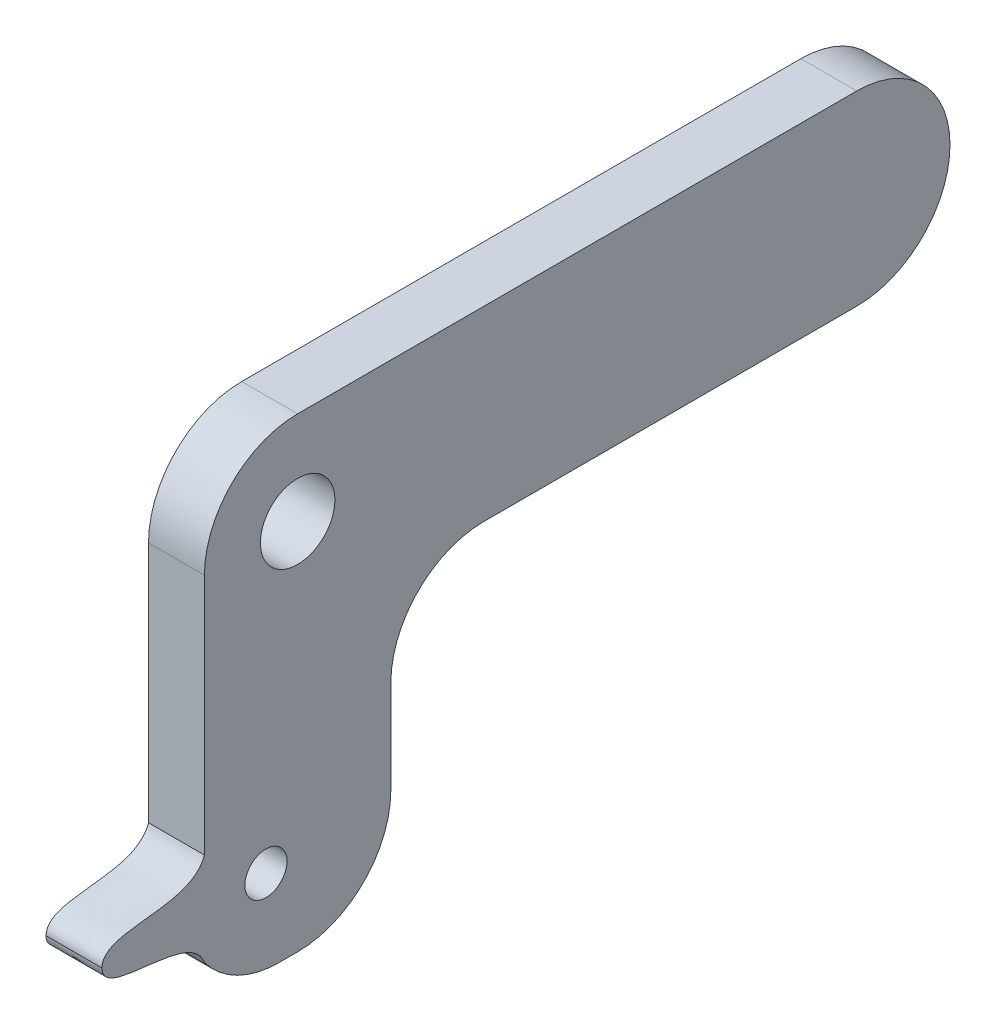
ISO-10303-21;
HEADER;
FILE_DESCRIPTION(('STEP AP214'),'2;1');
FILE_NAME('part.step','',(''),(''),'','','');
FILE_SCHEMA(('AUTOMOTIVE_DESIGN { 1 0 10303 214 1 1 1 1 }'));
ENDSEC;
DATA;
#1=APPLICATION_CONTEXT('core data for automotive mechanical design processes');
#2=APPLICATION_PROTOCOL_DEFINITION('international standard','automotive_design',2000,#1);
#3=PRODUCT_CONTEXT('',#1,'mechanical');
#4=PRODUCT('Part','Part','',(#3));
#5=PRODUCT_RELATED_PRODUCT_CATEGORY('part','',(#4));
#6=PRODUCT_DEFINITION_FORMATION('','',#4);
#7=PRODUCT_DEFINITION_CONTEXT('part definition',#1,'design');
#8=PRODUCT_DEFINITION('design','',#6,#7);
#9=PRODUCT_DEFINITION_SHAPE('','',#8);
#10=(LENGTH_UNIT() NAMED_UNIT(*) SI_UNIT(.MILLI.,.METRE.));
#11=(NAMED_UNIT(*) PLANE_ANGLE_UNIT() SI_UNIT($,.RADIAN.));
#12=(NAMED_UNIT(*) SI_UNIT($,.STERADIAN.) SOLID_ANGLE_UNIT());
#13=UNCERTAINTY_MEASURE_WITH_UNIT(LENGTH_MEASURE(1.E-05),#10,'distance_accuracy_value','');
#14=(GEOMETRIC_REPRESENTATION_CONTEXT(3) GLOBAL_UNCERTAINTY_ASSIGNED_CONTEXT((#13)) GLOBAL_UNIT_ASSIGNED_CONTEXT((#10,
#11,#12)) REPRESENTATION_CONTEXT('',''));
#15=CARTESIAN_POINT('',(0.,0.,0.));
#16=DIRECTION('',(0.,0.,1.));
#17=DIRECTION('',(1.,0.,0.));
#18=AXIS2_PLACEMENT_3D('',#15,#16,#17);
#19=CARTESIAN_POINT('',(3.,0.,0.));
#20=DIRECTION('',(-1.,0.,0.));
#21=DIRECTION('',(0.,0.,1.));
#22=AXIS2_PLACEMENT_3D('',#19,#20,#21);
#23=PLANE('',#22);
#24=CARTESIAN_POINT('',(3.,-15.5,1.7));
#25=DIRECTION('',(1.,0.,0.));
#26=DIRECTION('',(0.,0.,-1.));
#27=AXIS2_PLACEMENT_3D('',#24,#25,#26);
#28=CIRCLE('',#27,1.1303);
#29=CARTESIAN_POINT('',(3.,-15.5,0.569699999999999));
#30=VERTEX_POINT('',#29);
#31=EDGE_CURVE('E173',#30,#30,#28,.T.);
#32=ORIENTED_EDGE('',*,*,#31,.F.);
#33=EDGE_LOOP('',(#32));
#34=FACE_BOUND('',#33,.T.);
#35=CARTESIAN_POINT('',(3.,-15.5,10.4992612947399));
#36=CARTESIAN_POINT('',(3.,-17.2299880532221,10.4557311149623));
#37=CARTESIAN_POINT('',(3.,-15.917804838466,5.72140771644363));
#38=CARTESIAN_POINT('',(3.,-18.,5.));
#39=B_SPLINE_CURVE_WITH_KNOTS('',3,(#35,#36,#37,#38),.UNSPECIFIED.,.F.,.F.,(4,4),(0.,1.),.UNSPECIFIED.);
#40=CARTESIAN_POINT('',(3.,-15.5,10.4992612947399));
#41=VERTEX_POINT('',#40);
#42=CARTESIAN_POINT('',(3.,-18.,5.));
#43=VERTEX_POINT('',#42);
#44=EDGE_CURVE('E151',#41,#43,#39,.T.);
#45=ORIENTED_EDGE('',*,*,#44,.T.);
#46=CARTESIAN_POINT('',(3.,-15.,1.00000000000001));
#47=DIRECTION('',(-1.,0.,0.));
#48=DIRECTION('',(0.,0.,1.));
#49=AXIS2_PLACEMENT_3D('',#46,#47,#48);
#50=CIRCLE('',#49,5.);
#51=CARTESIAN_POINT('',(3.,-20.,1.00000000000001));
#52=VERTEX_POINT('',#51);
#53=EDGE_CURVE('E155',#43,#52,#50,.F.);
#54=ORIENTED_EDGE('',*,*,#53,.T.);
#55=DIRECTION('',(0.,0.,-1.));
#56=VECTOR('',#55,1.);
#57=CARTESIAN_POINT('',(3.,-20.,-5.));
#58=LINE('',#57,#56);
#59=CARTESIAN_POINT('',(3.,-20.,0.));
#60=VERTEX_POINT('',#59);
#61=EDGE_CURVE('E302',#52,#60,#58,.T.);
#62=ORIENTED_EDGE('',*,*,#61,.T.);
#63=CARTESIAN_POINT('',(3.,-15.,0.));
#64=DIRECTION('',(-1.,0.,0.));
#65=DIRECTION('',(0.,0.,1.));
#66=AXIS2_PLACEMENT_3D('',#63,#64,#65);
#67=CIRCLE('',#66,5.);
#68=CARTESIAN_POINT('',(3.,-15.,-5.));
#69=VERTEX_POINT('',#68);
#70=EDGE_CURVE('E259',#60,#69,#67,.F.);
#71=ORIENTED_EDGE('',*,*,#70,.T.);
#72=DIRECTION('',(0.,1.,0.));
#73=VECTOR('',#72,1.);
#74=CARTESIAN_POINT('',(3.,-5.,-5.));
#75=LINE('',#74,#73);
#76=CARTESIAN_POINT('',(3.,-10.,-5.));
#77=VERTEX_POINT('',#76);
#78=EDGE_CURVE('E296',#69,#77,#75,.T.);
#79=ORIENTED_EDGE('',*,*,#78,.T.);
#80=CARTESIAN_POINT('',(3.,-10.,-10.));
#81=DIRECTION('',(-1.,0.,0.));
#82=DIRECTION('',(0.,0.,1.));
#83=AXIS2_PLACEMENT_3D('',#80,#81,#82);
#84=CIRCLE('',#83,5.);
#85=CARTESIAN_POINT('',(3.,-5.,-10.));
#86=VERTEX_POINT('',#85);
#87=EDGE_CURVE('E11',#77,#86,#84,.T.);
#88=ORIENTED_EDGE('',*,*,#87,.T.);
#89=DIRECTION('',(0.,0.,-1.));
#90=VECTOR('',#89,1.);
#91=CARTESIAN_POINT('',(3.,-5.,-35.));
#92=LINE('',#91,#90);
#93=CARTESIAN_POINT('',(3.,-5.,-30.));
#94=VERTEX_POINT('',#93);
#95=EDGE_CURVE('E295',#86,#94,#92,.T.);
#96=ORIENTED_EDGE('',*,*,#95,.T.);
#97=CARTESIAN_POINT('',(3.,0.,-30.));
#98=DIRECTION('',(-1.,0.,0.));
#99=DIRECTION('',(0.,0.,1.));
#100=AXIS2_PLACEMENT_3D('',#97,#98,#99);
#101=CIRCLE('',#100,5.);
#102=CARTESIAN_POINT('',(3.,0.,-35.));
#103=VERTEX_POINT('',#102);
#104=EDGE_CURVE('E251',#94,#103,#101,.F.);
#105=ORIENTED_EDGE('',*,*,#104,.T.);
#106=CARTESIAN_POINT('',(3.,0.,-30.));
#107=DIRECTION('',(-1.,0.,0.));
#108=DIRECTION('',(0.,0.,1.));
#109=AXIS2_PLACEMENT_3D('',#106,#107,#108);
#110=CIRCLE('',#109,5.);
#111=CARTESIAN_POINT('',(3.,5.,-30.));
#112=VERTEX_POINT('',#111);
#113=EDGE_CURVE('E56',#103,#112,#110,.F.);
#114=ORIENTED_EDGE('',*,*,#113,.T.);
#115=DIRECTION('',(0.,0.,1.));
#116=VECTOR('',#115,1.);
#117=CARTESIAN_POINT('',(3.,5.,5.));
#118=LINE('',#117,#116);
#119=CARTESIAN_POINT('',(3.,5.,0.));
#120=VERTEX_POINT('',#119);
#121=EDGE_CURVE('E298',#112,#120,#118,.T.);
#122=ORIENTED_EDGE('',*,*,#121,.T.);
#123=CARTESIAN_POINT('',(3.,0.,0.));
#124=DIRECTION('',(-1.,0.,0.));
#125=DIRECTION('',(0.,0.,1.));
#126=AXIS2_PLACEMENT_3D('',#123,#124,#125);
#127=CIRCLE('',#126,5.);
#128=CARTESIAN_POINT('',(3.,0.,5.));
#129=VERTEX_POINT('',#128);
#130=EDGE_CURVE('E141',#120,#129,#127,.F.);
#131=ORIENTED_EDGE('',*,*,#130,.T.);
#132=DIRECTION('',(0.,-1.,0.));
#133=VECTOR('',#132,1.);
#134=CARTESIAN_POINT('',(3.,-20.,5.));
#135=LINE('',#134,#133);
#136=CARTESIAN_POINT('',(3.,-13.,5.));
#137=VERTEX_POINT('',#136);
#138=EDGE_CURVE('E254',#129,#137,#135,.T.);
#139=ORIENTED_EDGE('',*,*,#138,.T.);
#140=CARTESIAN_POINT('',(3.,-13.,5.));
#141=CARTESIAN_POINT('',(3.,-15.082195161534,5.72140771644363));
#142=CARTESIAN_POINT('',(3.,-13.7700119467779,10.4557311149623));
#143=CARTESIAN_POINT('',(3.,-15.5,10.4992612947399));
#144=B_SPLINE_CURVE_WITH_KNOTS('',3,(#140,#141,#142,#143),.UNSPECIFIED.,.F.,.F.,(4,4),(0.,1.),.UNSPECIFIED.);
#145=EDGE_CURVE('E334',#137,#41,#144,.T.);
#146=ORIENTED_EDGE('',*,*,#145,.T.);
#147=EDGE_LOOP('',(#45,#54,#62,#71,#79,#88,#96,#105,#114,#122,#131,#139,#146));
#148=FACE_BOUND('',#147,.T.);
#149=CARTESIAN_POINT('',(3.,0.,0.));
#150=DIRECTION('',(1.,0.,0.));
#151=DIRECTION('',(0.,0.,-1.));
#152=AXIS2_PLACEMENT_3D('',#149,#150,#151);
#153=CIRCLE('',#152,2.);
#154=CARTESIAN_POINT('',(3.,0.,-2.));
#155=VERTEX_POINT('',#154);
#156=EDGE_CURVE('E312',#155,#155,#153,.T.);
#157=ORIENTED_EDGE('',*,*,#156,.F.);
#158=EDGE_LOOP('',(#157));
#159=FACE_BOUND('',#158,.T.);
#160=ADVANCED_FACE('F33',(#34,#148,#159),#23,.F.);
#161=CARTESIAN_POINT('',(0.,0.,0.));
#162=DIRECTION('',(-1.,0.,0.));
#163=DIRECTION('',(0.,0.,1.));
#164=AXIS2_PLACEMENT_3D('',#161,#162,#163);
#165=PLANE('',#164);
#166=CARTESIAN_POINT('',(0.,-15.5,1.7));
#167=DIRECTION('',(1.,0.,0.));
#168=DIRECTION('',(0.,0.,-1.));
#169=AXIS2_PLACEMENT_3D('',#166,#167,#168);
#170=CIRCLE('',#169,1.1303);
#171=CARTESIAN_POINT('',(0.,-15.5,0.569699999999999));
#172=VERTEX_POINT('',#171);
#173=EDGE_CURVE('E367',#172,#172,#170,.T.);
#174=ORIENTED_EDGE('',*,*,#173,.T.);
#175=EDGE_LOOP('',(#174));
#176=FACE_BOUND('',#175,.T.);
#177=DIRECTION('',(0.,0.,-1.));
#178=VECTOR('',#177,1.);
#179=CARTESIAN_POINT('',(0.,-20.,-5.));
#180=LINE('',#179,#178);
#181=CARTESIAN_POINT('',(0.,-20.,1.00000000000001));
#182=VERTEX_POINT('',#181);
#183=CARTESIAN_POINT('',(0.,-20.,0.));
#184=VERTEX_POINT('',#183);
#185=EDGE_CURVE('E136',#182,#184,#180,.T.);
#186=ORIENTED_EDGE('',*,*,#185,.F.);
#187=CARTESIAN_POINT('',(0.,-15.,1.00000000000001));
#188=DIRECTION('',(-1.,0.,0.));
#189=DIRECTION('',(0.,0.,1.));
#190=AXIS2_PLACEMENT_3D('',#187,#188,#189);
#191=CIRCLE('',#190,5.);
#192=CARTESIAN_POINT('',(0.,-18.,5.));
#193=VERTEX_POINT('',#192);
#194=EDGE_CURVE('E128',#182,#193,#191,.T.);
#195=ORIENTED_EDGE('',*,*,#194,.T.);
#196=CARTESIAN_POINT('',(0.,-15.5,10.4992612947399));
#197=CARTESIAN_POINT('',(0.,-17.2299880532221,10.4557311149623));
#198=CARTESIAN_POINT('',(0.,-15.917804838466,5.72140771644363));
#199=CARTESIAN_POINT('',(0.,-18.,5.));
#200=B_SPLINE_CURVE_WITH_KNOTS('',3,(#196,#197,#198,#199),.UNSPECIFIED.,.F.,.F.,(4,4),(0.,1.),.UNSPECIFIED.);
#201=CARTESIAN_POINT('',(0.,-15.5,10.4992612947399));
#202=VERTEX_POINT('',#201);
#203=EDGE_CURVE('E133',#202,#193,#200,.T.);
#204=ORIENTED_EDGE('',*,*,#203,.F.);
#205=CARTESIAN_POINT('',(0.,-13.,5.));
#206=CARTESIAN_POINT('',(0.,-15.082195161534,5.72140771644363));
#207=CARTESIAN_POINT('',(0.,-13.7700119467779,10.4557311149623));
#208=CARTESIAN_POINT('',(0.,-15.5,10.4992612947399));
#209=B_SPLINE_CURVE_WITH_KNOTS('',3,(#205,#206,#207,#208),.UNSPECIFIED.,.F.,.F.,(4,4),(0.,1.),.UNSPECIFIED.);
#210=CARTESIAN_POINT('',(0.,-13.,5.));
#211=VERTEX_POINT('',#210);
#212=EDGE_CURVE('E159',#211,#202,#209,.T.);
#213=ORIENTED_EDGE('',*,*,#212,.F.);
#214=DIRECTION('',(0.,-1.,0.));
#215=VECTOR('',#214,1.);
#216=CARTESIAN_POINT('',(0.,-20.,5.));
#217=LINE('',#216,#215);
#218=CARTESIAN_POINT('',(0.,0.,5.));
#219=VERTEX_POINT('',#218);
#220=EDGE_CURVE('E309',#219,#211,#217,.T.);
#221=ORIENTED_EDGE('',*,*,#220,.F.);
#222=CARTESIAN_POINT('',(0.,0.,0.));
#223=DIRECTION('',(-1.,0.,0.));
#224=DIRECTION('',(0.,0.,1.));
#225=AXIS2_PLACEMENT_3D('',#222,#223,#224);
#226=CIRCLE('',#225,5.);
#227=CARTESIAN_POINT('',(0.,5.,0.));
#228=VERTEX_POINT('',#227);
#229=EDGE_CURVE('E315',#219,#228,#226,.T.);
#230=ORIENTED_EDGE('',*,*,#229,.T.);
#231=DIRECTION('',(0.,0.,1.));
#232=VECTOR('',#231,1.);
#233=CARTESIAN_POINT('',(0.,5.,5.));
#234=LINE('',#233,#232);
#235=CARTESIAN_POINT('',(0.,5.,-30.));
#236=VERTEX_POINT('',#235);
#237=EDGE_CURVE('E347',#236,#228,#234,.T.);
#238=ORIENTED_EDGE('',*,*,#237,.F.);
#239=CARTESIAN_POINT('',(0.,0.,-30.));
#240=DIRECTION('',(-1.,0.,0.));
#241=DIRECTION('',(0.,0.,1.));
#242=AXIS2_PLACEMENT_3D('',#239,#240,#241);
#243=CIRCLE('',#242,5.);
#244=CARTESIAN_POINT('',(0.,0.,-35.));
#245=VERTEX_POINT('',#244);
#246=EDGE_CURVE('E317',#236,#245,#243,.T.);
#247=ORIENTED_EDGE('',*,*,#246,.T.);
#248=CARTESIAN_POINT('',(0.,0.,-30.));
#249=DIRECTION('',(-1.,0.,0.));
#250=DIRECTION('',(0.,0.,1.));
#251=AXIS2_PLACEMENT_3D('',#248,#249,#250);
#252=CIRCLE('',#251,5.);
#253=CARTESIAN_POINT('',(0.,-5.,-30.));
#254=VERTEX_POINT('',#253);
#255=EDGE_CURVE('E319',#245,#254,#252,.T.);
#256=ORIENTED_EDGE('',*,*,#255,.T.);
#257=DIRECTION('',(0.,0.,-1.));
#258=VECTOR('',#257,1.);
#259=CARTESIAN_POINT('',(0.,-5.,-35.));
#260=LINE('',#259,#258);
#261=CARTESIAN_POINT('',(0.,-5.,-10.));
#262=VERTEX_POINT('',#261);
#263=EDGE_CURVE('E284',#262,#254,#260,.T.);
#264=ORIENTED_EDGE('',*,*,#263,.F.);
#265=CARTESIAN_POINT('',(0.,-10.,-10.));
#266=DIRECTION('',(-1.,0.,0.));
#267=DIRECTION('',(0.,0.,1.));
#268=AXIS2_PLACEMENT_3D('',#265,#266,#267);
#269=CIRCLE('',#268,5.);
#270=CARTESIAN_POINT('',(0.,-10.,-5.));
#271=VERTEX_POINT('',#270);
#272=EDGE_CURVE('E42',#262,#271,#269,.F.);
#273=ORIENTED_EDGE('',*,*,#272,.T.);
#274=DIRECTION('',(0.,1.,0.));
#275=VECTOR('',#274,1.);
#276=CARTESIAN_POINT('',(0.,-5.,-5.));
#277=LINE('',#276,#275);
#278=CARTESIAN_POINT('',(0.,-15.,-5.));
#279=VERTEX_POINT('',#278);
#280=EDGE_CURVE('E282',#279,#271,#277,.T.);
#281=ORIENTED_EDGE('',*,*,#280,.F.);
#282=CARTESIAN_POINT('',(0.,-15.,0.));
#283=DIRECTION('',(-1.,0.,0.));
#284=DIRECTION('',(0.,0.,1.));
#285=AXIS2_PLACEMENT_3D('',#282,#283,#284);
#286=CIRCLE('',#285,5.);
#287=EDGE_CURVE('E142',#279,#184,#286,.T.);
#288=ORIENTED_EDGE('',*,*,#287,.T.);
#289=EDGE_LOOP('',(#186,#195,#204,#213,#221,#230,#238,#247,#256,#264,#273,#281,#288));
#290=FACE_BOUND('',#289,.T.);
#291=CARTESIAN_POINT('',(0.,0.,0.));
#292=DIRECTION('',(1.,0.,0.));
#293=DIRECTION('',(0.,0.,-1.));
#294=AXIS2_PLACEMENT_3D('',#291,#292,#293);
#295=CIRCLE('',#294,2.);
#296=CARTESIAN_POINT('',(0.,0.,-2.));
#297=VERTEX_POINT('',#296);
#298=EDGE_CURVE('E364',#297,#297,#295,.T.);
#299=ORIENTED_EDGE('',*,*,#298,.T.);
#300=EDGE_LOOP('',(#299));
#301=FACE_BOUND('',#300,.T.);
#302=ADVANCED_FACE('F130',(#176,#290,#301),#165,.T.);
#303=CARTESIAN_POINT('',(3.,-20.,5.));
#304=DIRECTION('',(0.,0.,-1.));
#305=DIRECTION('',(0.,1.,0.));
#306=AXIS2_PLACEMENT_3D('',#303,#304,#305);
#307=PLANE('',#306);
#308=ORIENTED_EDGE('',*,*,#138,.F.);
#309=DIRECTION('',(-1.,0.,0.));
#310=VECTOR('',#309,1.);
#311=CARTESIAN_POINT('',(3.,0.,5.));
#312=LINE('',#311,#310);
#313=EDGE_CURVE('E248',#129,#219,#312,.T.);
#314=ORIENTED_EDGE('',*,*,#313,.T.);
#315=ORIENTED_EDGE('',*,*,#220,.T.);
#316=DIRECTION('',(1.,0.,0.));
#317=VECTOR('',#316,1.);
#318=CARTESIAN_POINT('',(-7.43248779264549,-13.,5.));
#319=LINE('',#318,#317);
#320=EDGE_CURVE('E156',#211,#137,#319,.T.);
#321=ORIENTED_EDGE('',*,*,#320,.T.);
#322=EDGE_LOOP('',(#308,#314,#315,#321));
#323=FACE_BOUND('',#322,.T.);
#324=ADVANCED_FACE('F206',(#323),#307,.F.);
#325=CARTESIAN_POINT('',(3.,-20.,-5.));
#326=DIRECTION('',(0.,1.,0.));
#327=DIRECTION('',(0.,0.,1.));
#328=AXIS2_PLACEMENT_3D('',#325,#326,#327);
#329=PLANE('',#328);
#330=ORIENTED_EDGE('',*,*,#61,.F.);
#331=DIRECTION('',(1.,0.,0.));
#332=VECTOR('',#331,1.);
#333=CARTESIAN_POINT('',(3.,-20.,1.00000000000001));
#334=LINE('',#333,#332);
#335=EDGE_CURVE('E313',#52,#182,#334,.F.);
#336=ORIENTED_EDGE('',*,*,#335,.T.);
#337=ORIENTED_EDGE('',*,*,#185,.T.);
#338=DIRECTION('',(-1.,0.,0.));
#339=VECTOR('',#338,1.);
#340=CARTESIAN_POINT('',(3.,-20.,0.));
#341=LINE('',#340,#339);
#342=EDGE_CURVE('E300',#184,#60,#341,.F.);
#343=ORIENTED_EDGE('',*,*,#342,.T.);
#344=EDGE_LOOP('',(#330,#336,#337,#343));
#345=FACE_BOUND('',#344,.T.);
#346=ADVANCED_FACE('F217',(#345),#329,.F.);
#347=CARTESIAN_POINT('',(3.,-5.,-5.));
#348=DIRECTION('',(0.,0.,1.));
#349=DIRECTION('',(0.,-1.,0.));
#350=AXIS2_PLACEMENT_3D('',#347,#348,#349);
#351=PLANE('',#350);
#352=ORIENTED_EDGE('',*,*,#78,.F.);
#353=DIRECTION('',(-1.,0.,0.));
#354=VECTOR('',#353,1.);
#355=CARTESIAN_POINT('',(3.,-15.,-5.));
#356=LINE('',#355,#354);
#357=EDGE_CURVE('E266',#69,#279,#356,.T.);
#358=ORIENTED_EDGE('',*,*,#357,.T.);
#359=ORIENTED_EDGE('',*,*,#280,.T.);
#360=DIRECTION('',(-1.,0.,0.));
#361=VECTOR('',#360,1.);
#362=CARTESIAN_POINT('',(3.,-10.,-5.));
#363=LINE('',#362,#361);
#364=EDGE_CURVE('E262',#271,#77,#363,.F.);
#365=ORIENTED_EDGE('',*,*,#364,.T.);
#366=EDGE_LOOP('',(#352,#358,#359,#365));
#367=FACE_BOUND('',#366,.T.);
#368=ADVANCED_FACE('F213',(#367),#351,.F.);
#369=CARTESIAN_POINT('',(3.,-5.,-35.));
#370=DIRECTION('',(0.,1.,0.));
#371=DIRECTION('',(0.,0.,1.));
#372=AXIS2_PLACEMENT_3D('',#369,#370,#371);
#373=PLANE('',#372);
#374=ORIENTED_EDGE('',*,*,#263,.T.);
#375=DIRECTION('',(-1.,0.,0.));
#376=VECTOR('',#375,1.);
#377=CARTESIAN_POINT('',(3.,-5.,-30.));
#378=LINE('',#377,#376);
#379=EDGE_CURVE('E272',#254,#94,#378,.F.);
#380=ORIENTED_EDGE('',*,*,#379,.T.);
#381=ORIENTED_EDGE('',*,*,#95,.F.);
#382=DIRECTION('',(-1.,0.,0.));
#383=VECTOR('',#382,1.);
#384=CARTESIAN_POINT('',(0.,-5.,-10.));
#385=LINE('',#384,#383);
#386=EDGE_CURVE('E269',#86,#262,#385,.T.);
#387=ORIENTED_EDGE('',*,*,#386,.T.);
#388=EDGE_LOOP('',(#374,#380,#381,#387));
#389=FACE_BOUND('',#388,.T.);
#390=ADVANCED_FACE('F210',(#389),#373,.F.);
#391=CARTESIAN_POINT('',(3.,5.,5.));
#392=DIRECTION('',(0.,-1.,0.));
#393=DIRECTION('',(0.,0.,-1.));
#394=AXIS2_PLACEMENT_3D('',#391,#392,#393);
#395=PLANE('',#394);
#396=ORIENTED_EDGE('',*,*,#121,.F.);
#397=DIRECTION('',(-1.,0.,0.));
#398=VECTOR('',#397,1.);
#399=CARTESIAN_POINT('',(3.,5.,-30.));
#400=LINE('',#399,#398);
#401=EDGE_CURVE('E276',#112,#236,#400,.T.);
#402=ORIENTED_EDGE('',*,*,#401,.T.);
#403=ORIENTED_EDGE('',*,*,#237,.T.);
#404=DIRECTION('',(-1.,0.,0.));
#405=VECTOR('',#404,1.);
#406=CARTESIAN_POINT('',(3.,5.,0.));
#407=LINE('',#406,#405);
#408=EDGE_CURVE('E49',#228,#120,#407,.F.);
#409=ORIENTED_EDGE('',*,*,#408,.T.);
#410=EDGE_LOOP('',(#396,#402,#403,#409));
#411=FACE_BOUND('',#410,.T.);
#412=ADVANCED_FACE('F199',(#411),#395,.F.);
#413=CARTESIAN_POINT('',(3.,0.,0.));
#414=DIRECTION('',(-1.,0.,0.));
#415=DIRECTION('',(0.,0.,1.));
#416=AXIS2_PLACEMENT_3D('',#413,#414,#415);
#417=CYLINDRICAL_SURFACE('',#416,2.);
#418=ORIENTED_EDGE('',*,*,#156,.T.);
#419=EDGE_LOOP('',(#418));
#420=FACE_BOUND('',#419,.T.);
#421=ORIENTED_EDGE('',*,*,#298,.F.);
#422=EDGE_LOOP('',(#421));
#423=FACE_BOUND('',#422,.T.);
#424=ADVANCED_FACE('F195',(#420,#423),#417,.F.);
#425=CARTESIAN_POINT('',(0.,-15.5,1.7));
#426=DIRECTION('',(1.,0.,0.));
#427=DIRECTION('',(0.,0.,-1.));
#428=AXIS2_PLACEMENT_3D('',#425,#426,#427);
#429=CYLINDRICAL_SURFACE('',#428,1.1303);
#430=ORIENTED_EDGE('',*,*,#173,.F.);
#431=EDGE_LOOP('',(#430));
#432=FACE_BOUND('',#431,.T.);
#433=ORIENTED_EDGE('',*,*,#31,.T.);
#434=EDGE_LOOP('',(#433));
#435=FACE_BOUND('',#434,.T.);
#436=ADVANCED_FACE('F192',(#432,#435),#429,.F.);
#437=CARTESIAN_POINT('',(-7.43248779264549,-15.5,10.4992612947399));
#438=CARTESIAN_POINT('',(-7.43248779264549,-17.2299880532221,10.4557311149623));
#439=CARTESIAN_POINT('',(-7.43248779264549,-15.917804838466,5.72140771644363));
#440=CARTESIAN_POINT('',(-7.43248779264549,-18.,5.));
#441=B_SPLINE_CURVE_WITH_KNOTS('',3,(#437,#438,#439,#440),.UNSPECIFIED.,.F.,.F.,(4,4),(0.,1.),.UNSPECIFIED.);
#442=DIRECTION('',(1.,0.,0.));
#443=VECTOR('',#442,1.);
#444=SURFACE_OF_LINEAR_EXTRUSION('',#441,#443);
#445=DIRECTION('',(1.,0.,0.));
#446=VECTOR('',#445,1.);
#447=CARTESIAN_POINT('',(-7.43248779264549,-15.5,10.4992612947399));
#448=LINE('',#447,#446);
#449=EDGE_CURVE('E150',#202,#41,#448,.T.);
#450=ORIENTED_EDGE('',*,*,#449,.F.);
#451=ORIENTED_EDGE('',*,*,#203,.T.);
#452=DIRECTION('',(1.,0.,0.));
#453=VECTOR('',#452,1.);
#454=CARTESIAN_POINT('',(-7.43248779264549,-18.,5.));
#455=LINE('',#454,#453);
#456=EDGE_CURVE('E148',#193,#43,#455,.T.);
#457=ORIENTED_EDGE('',*,*,#456,.T.);
#458=ORIENTED_EDGE('',*,*,#44,.F.);
#459=EDGE_LOOP('',(#450,#451,#457,#458));
#460=FACE_BOUND('',#459,.T.);
#461=ADVANCED_FACE('F146',(#460),#444,.T.);
#462=CARTESIAN_POINT('',(-7.43248779264549,-13.,5.));
#463=CARTESIAN_POINT('',(-7.43248779264549,-15.082195161534,5.72140771644363));
#464=CARTESIAN_POINT('',(-7.43248779264549,-13.7700119467779,10.4557311149623));
#465=CARTESIAN_POINT('',(-7.43248779264549,-15.5,10.4992612947399));
#466=B_SPLINE_CURVE_WITH_KNOTS('',3,(#462,#463,#464,#465),.UNSPECIFIED.,.F.,.F.,(4,4),(0.,1.),.UNSPECIFIED.);
#467=DIRECTION('',(1.,0.,0.));
#468=VECTOR('',#467,1.);
#469=SURFACE_OF_LINEAR_EXTRUSION('',#466,#468);
#470=ORIENTED_EDGE('',*,*,#320,.F.);
#471=ORIENTED_EDGE('',*,*,#212,.T.);
#472=ORIENTED_EDGE('',*,*,#449,.T.);
#473=ORIENTED_EDGE('',*,*,#145,.F.);
#474=EDGE_LOOP('',(#470,#471,#472,#473));
#475=FACE_BOUND('',#474,.T.);
#476=ADVANCED_FACE('F186',(#475),#469,.T.);
#477=CARTESIAN_POINT('',(1.49999999999999,-15.,1.00000000000001));
#478=DIRECTION('',(1.,0.,0.));
#479=DIRECTION('',(0.,0.,-1.));
#480=AXIS2_PLACEMENT_3D('',#477,#478,#479);
#481=CYLINDRICAL_SURFACE('',#480,5.);
#482=ORIENTED_EDGE('',*,*,#53,.F.);
#483=ORIENTED_EDGE('',*,*,#456,.F.);
#484=ORIENTED_EDGE('',*,*,#194,.F.);
#485=ORIENTED_EDGE('',*,*,#335,.F.);
#486=EDGE_LOOP('',(#482,#483,#484,#485));
#487=FACE_BOUND('',#486,.T.);
#488=ADVANCED_FACE('F154',(#487),#481,.T.);
#489=CARTESIAN_POINT('',(3.,-15.,0.));
#490=DIRECTION('',(-1.,0.,0.));
#491=DIRECTION('',(0.,0.,1.));
#492=AXIS2_PLACEMENT_3D('',#489,#490,#491);
#493=CYLINDRICAL_SURFACE('',#492,5.);
#494=ORIENTED_EDGE('',*,*,#70,.F.);
#495=ORIENTED_EDGE('',*,*,#342,.F.);
#496=ORIENTED_EDGE('',*,*,#287,.F.);
#497=ORIENTED_EDGE('',*,*,#357,.F.);
#498=EDGE_LOOP('',(#494,#495,#496,#497));
#499=FACE_BOUND('',#498,.T.);
#500=ADVANCED_FACE('F227',(#499),#493,.T.);
#501=CARTESIAN_POINT('',(3.,0.,-30.));
#502=DIRECTION('',(-1.,0.,0.));
#503=DIRECTION('',(0.,0.,1.));
#504=AXIS2_PLACEMENT_3D('',#501,#502,#503);
#505=CYLINDRICAL_SURFACE('',#504,5.);
#506=ORIENTED_EDGE('',*,*,#401,.F.);
#507=ORIENTED_EDGE('',*,*,#113,.F.);
#508=DIRECTION('',(-1.,0.,0.));
#509=VECTOR('',#508,1.);
#510=CARTESIAN_POINT('',(3.,0.,-35.));
#511=LINE('',#510,#509);
#512=EDGE_CURVE('E37',#245,#103,#511,.F.);
#513=ORIENTED_EDGE('',*,*,#512,.F.);
#514=ORIENTED_EDGE('',*,*,#246,.F.);
#515=EDGE_LOOP('',(#506,#507,#513,#514));
#516=FACE_BOUND('',#515,.T.);
#517=ADVANCED_FACE('F230',(#516),#505,.T.);
#518=CARTESIAN_POINT('',(3.,0.,-30.));
#519=DIRECTION('',(-1.,0.,0.));
#520=DIRECTION('',(0.,0.,1.));
#521=AXIS2_PLACEMENT_3D('',#518,#519,#520);
#522=CYLINDRICAL_SURFACE('',#521,5.);
#523=ORIENTED_EDGE('',*,*,#104,.F.);
#524=ORIENTED_EDGE('',*,*,#379,.F.);
#525=ORIENTED_EDGE('',*,*,#255,.F.);
#526=ORIENTED_EDGE('',*,*,#512,.T.);
#527=EDGE_LOOP('',(#523,#524,#525,#526));
#528=FACE_BOUND('',#527,.T.);
#529=ADVANCED_FACE('F232',(#528),#522,.T.);
#530=CARTESIAN_POINT('',(3.,0.,0.));
#531=DIRECTION('',(-1.,0.,0.));
#532=DIRECTION('',(0.,0.,1.));
#533=AXIS2_PLACEMENT_3D('',#530,#531,#532);
#534=CYLINDRICAL_SURFACE('',#533,5.);
#535=ORIENTED_EDGE('',*,*,#130,.F.);
#536=ORIENTED_EDGE('',*,*,#408,.F.);
#537=ORIENTED_EDGE('',*,*,#229,.F.);
#538=ORIENTED_EDGE('',*,*,#313,.F.);
#539=EDGE_LOOP('',(#535,#536,#537,#538));
#540=FACE_BOUND('',#539,.T.);
#541=ADVANCED_FACE('F235',(#540),#534,.T.);
#542=CARTESIAN_POINT('',(3.,-10.,-10.));
#543=DIRECTION('',(1.,0.,0.));
#544=DIRECTION('',(0.,0.,-1.));
#545=AXIS2_PLACEMENT_3D('',#542,#543,#544);
#546=CYLINDRICAL_SURFACE('',#545,5.);
#547=ORIENTED_EDGE('',*,*,#87,.F.);
#548=ORIENTED_EDGE('',*,*,#364,.F.);
#549=ORIENTED_EDGE('',*,*,#272,.F.);
#550=ORIENTED_EDGE('',*,*,#386,.F.);
#551=EDGE_LOOP('',(#547,#548,#549,#550));
#552=FACE_BOUND('',#551,.T.);
#553=ADVANCED_FACE('F35',(#552),#546,.F.);
#554=CLOSED_SHELL('',(#160,#302,#324,#346,#368,#390,#412,#424,#436,#461,#476,#488,#500,#517,
#529,#541,#553));
#555=MANIFOLD_SOLID_BREP('B2',#554);
#556=ADVANCED_BREP_SHAPE_REPRESENTATION('',(#18,#555),#14);
#557=SHAPE_DEFINITION_REPRESENTATION(#9,#556);
ENDSEC;
END-ISO-10303-21;
